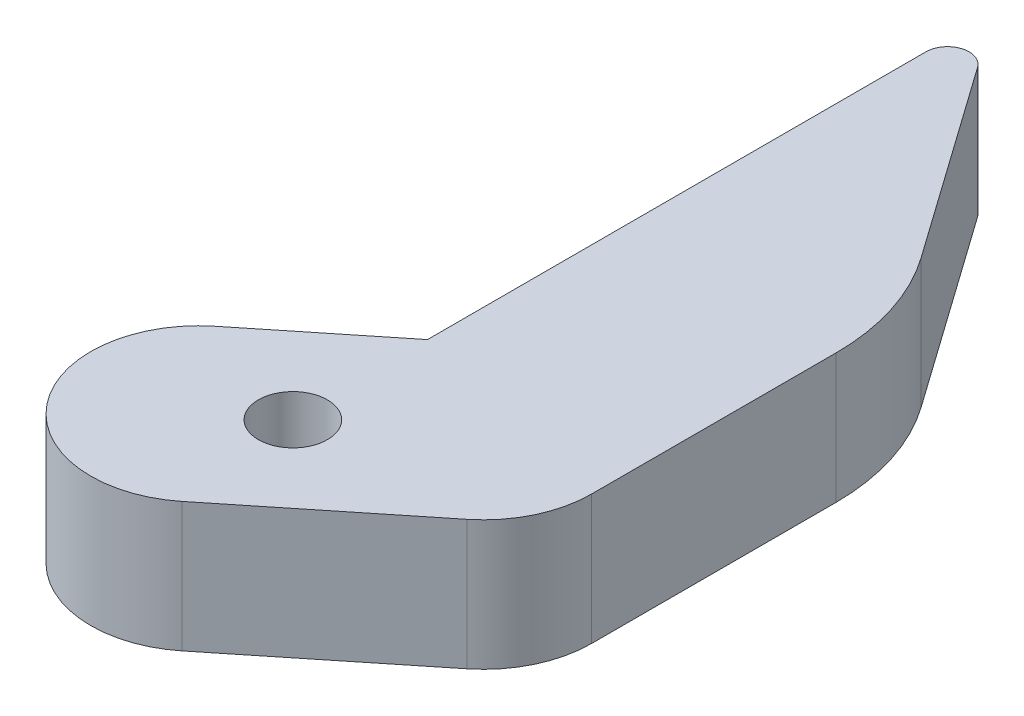
ISO-10303-21;
HEADER;
FILE_DESCRIPTION(('STEP AP214'),'2;1');
FILE_NAME('part.step','',(''),(''),'','','');
FILE_SCHEMA(('AUTOMOTIVE_DESIGN { 1 0 10303 214 1 1 1 1 }'));
ENDSEC;
DATA;
#1=APPLICATION_CONTEXT('core data for automotive mechanical design processes');
#2=APPLICATION_PROTOCOL_DEFINITION('international standard','automotive_design',2000,#1);
#3=PRODUCT_CONTEXT('',#1,'mechanical');
#4=PRODUCT('Part','Part','',(#3));
#5=PRODUCT_RELATED_PRODUCT_CATEGORY('part','',(#4));
#6=PRODUCT_DEFINITION_FORMATION('','',#4);
#7=PRODUCT_DEFINITION_CONTEXT('part definition',#1,'design');
#8=PRODUCT_DEFINITION('design','',#6,#7);
#9=PRODUCT_DEFINITION_SHAPE('','',#8);
#10=(LENGTH_UNIT() NAMED_UNIT(*) SI_UNIT(.MILLI.,.METRE.));
#11=(NAMED_UNIT(*) PLANE_ANGLE_UNIT() SI_UNIT($,.RADIAN.));
#12=(NAMED_UNIT(*) SI_UNIT($,.STERADIAN.) SOLID_ANGLE_UNIT());
#13=UNCERTAINTY_MEASURE_WITH_UNIT(LENGTH_MEASURE(1.E-05),#10,'distance_accuracy_value','');
#14=(GEOMETRIC_REPRESENTATION_CONTEXT(3) GLOBAL_UNCERTAINTY_ASSIGNED_CONTEXT((#13)) GLOBAL_UNIT_ASSIGNED_CONTEXT((#10,
#11,#12)) REPRESENTATION_CONTEXT('',''));
#15=CARTESIAN_POINT('',(0.,0.,0.));
#16=DIRECTION('',(0.,0.,1.));
#17=DIRECTION('',(1.,0.,0.));
#18=AXIS2_PLACEMENT_3D('',#15,#16,#17);
#19=CARTESIAN_POINT('',(-2.42195887519577,-6.,1.94672229834054));
#20=DIRECTION('',(0.,-1.,0.));
#21=DIRECTION('',(0.,0.,-1.));
#22=AXIS2_PLACEMENT_3D('',#19,#20,#21);
#23=CYLINDRICAL_SURFACE('',#22,4.99999999999996);
#24=CARTESIAN_POINT('',(-2.42195887519577,-12.,1.94672229834054));
#25=DIRECTION('',(0.,-1.,0.));
#26=DIRECTION('',(0.,0.,-1.));
#27=AXIS2_PLACEMENT_3D('',#24,#25,#26);
#28=CIRCLE('',#27,4.99999999999996);
#29=CARTESIAN_POINT('',(0.710490736046218,-12.,5.84386990050156));
#30=VERTEX_POINT('',#29);
#31=CARTESIAN_POINT('',(-5.55440848643782,-12.,-1.95042530382048));
#32=VERTEX_POINT('',#31);
#33=EDGE_CURVE('E180',#30,#32,#28,.T.);
#34=ORIENTED_EDGE('',*,*,#33,.F.);
#35=DIRECTION('',(0.,-1.,0.));
#36=VECTOR('',#35,1.);
#37=CARTESIAN_POINT('',(0.710490736046218,-6.,5.84386990050156));
#38=LINE('',#37,#36);
#39=CARTESIAN_POINT('',(0.710490736046218,-6.,5.84386990050156));
#40=VERTEX_POINT('',#39);
#41=EDGE_CURVE('E155',#40,#30,#38,.T.);
#42=ORIENTED_EDGE('',*,*,#41,.F.);
#43=CARTESIAN_POINT('',(-2.42195887519577,-6.,1.94672229834054));
#44=DIRECTION('',(0.,-1.,0.));
#45=DIRECTION('',(0.,0.,-1.));
#46=AXIS2_PLACEMENT_3D('',#43,#44,#45);
#47=CIRCLE('',#46,4.99999999999996);
#48=CARTESIAN_POINT('',(-5.55440848643782,-6.,-1.95042530382048));
#49=VERTEX_POINT('',#48);
#50=EDGE_CURVE('E172',#40,#49,#47,.T.);
#51=ORIENTED_EDGE('',*,*,#50,.T.);
#52=DIRECTION('',(0.,-1.,0.));
#53=VECTOR('',#52,1.);
#54=CARTESIAN_POINT('',(-5.55440848643782,-6.,-1.95042530382048));
#55=LINE('',#54,#53);
#56=EDGE_CURVE('E156',#49,#32,#55,.T.);
#57=ORIENTED_EDGE('',*,*,#56,.T.);
#58=EDGE_LOOP('',(#34,#42,#51,#57));
#59=FACE_BOUND('',#58,.T.);
#60=ADVANCED_FACE('F38',(#59),#23,.T.);
#61=CARTESIAN_POINT('',(8.03404776782973,-6.,-0.0426593560239417));
#62=DIRECTION('',(0.626489922248408,0.,0.779429520432209));
#63=DIRECTION('',(0.779429520432209,0.,-0.626489922248408));
#64=AXIS2_PLACEMENT_3D('',#61,#62,#63);
#65=PLANE('',#64);
#66=DIRECTION('',(-0.779429520432209,0.,0.626489922248408));
#67=VECTOR('',#66,1.);
#68=CARTESIAN_POINT('',(8.03404776782973,-12.,-0.0426593560239417));
#69=LINE('',#68,#67);
#70=CARTESIAN_POINT('',(8.03404776782973,-12.,-0.0426593560239417));
#71=VERTEX_POINT('',#70);
#72=EDGE_CURVE('E167',#71,#30,#69,.T.);
#73=ORIENTED_EDGE('',*,*,#72,.F.);
#74=DIRECTION('',(0.,-1.,0.));
#75=VECTOR('',#74,1.);
#76=CARTESIAN_POINT('',(8.03404776782973,-6.,-0.0426593560239417));
#77=LINE('',#76,#75);
#78=CARTESIAN_POINT('',(8.03404776782973,-6.,-0.0426593560239417));
#79=VERTEX_POINT('',#78);
#80=EDGE_CURVE('E164',#79,#71,#77,.T.);
#81=ORIENTED_EDGE('',*,*,#80,.F.);
#82=DIRECTION('',(-0.779429520432209,0.,0.626489922248408));
#83=VECTOR('',#82,1.);
#84=CARTESIAN_POINT('',(8.03404776782973,-6.,-0.0426593560239417));
#85=LINE('',#84,#83);
#86=EDGE_CURVE('E159',#79,#40,#85,.T.);
#87=ORIENTED_EDGE('',*,*,#86,.T.);
#88=ORIENTED_EDGE('',*,*,#41,.T.);
#89=EDGE_LOOP('',(#73,#81,#87,#88));
#90=FACE_BOUND('',#89,.T.);
#91=ADVANCED_FACE('F198',(#90),#65,.T.);
#92=CARTESIAN_POINT('',(4.90159815658769,-6.,-3.93980695818495));
#93=DIRECTION('',(0.,-1.,0.));
#94=DIRECTION('',(0.,0.,-1.));
#95=AXIS2_PLACEMENT_3D('',#92,#93,#94);
#96=CYLINDRICAL_SURFACE('',#95,4.99999999999999);
#97=CARTESIAN_POINT('',(4.90159815658769,-12.,-3.93980695818495));
#98=DIRECTION('',(0.,-1.,0.));
#99=DIRECTION('',(0.,0.,-1.));
#100=AXIS2_PLACEMENT_3D('',#97,#98,#99);
#101=CIRCLE('',#100,4.99999999999999);
#102=CARTESIAN_POINT('',(9.90159815658768,-12.,-3.93980695818495));
#103=VERTEX_POINT('',#102);
#104=EDGE_CURVE('E173',#103,#71,#101,.T.);
#105=ORIENTED_EDGE('',*,*,#104,.F.);
#106=DIRECTION('',(0.,-1.,0.));
#107=VECTOR('',#106,1.);
#108=CARTESIAN_POINT('',(9.90159815658768,-6.,-3.93980695818495));
#109=LINE('',#108,#107);
#110=CARTESIAN_POINT('',(9.90159815658768,-6.,-3.93980695818495));
#111=VERTEX_POINT('',#110);
#112=EDGE_CURVE('E161',#111,#103,#109,.T.);
#113=ORIENTED_EDGE('',*,*,#112,.F.);
#114=CARTESIAN_POINT('',(4.90159815658769,-6.,-3.93980695818495));
#115=DIRECTION('',(0.,-1.,0.));
#116=DIRECTION('',(0.,0.,-1.));
#117=AXIS2_PLACEMENT_3D('',#114,#115,#116);
#118=CIRCLE('',#117,4.99999999999999);
#119=EDGE_CURVE('E216',#111,#79,#118,.T.);
#120=ORIENTED_EDGE('',*,*,#119,.T.);
#121=ORIENTED_EDGE('',*,*,#80,.T.);
#122=EDGE_LOOP('',(#105,#113,#120,#121));
#123=FACE_BOUND('',#122,.T.);
#124=ADVANCED_FACE('F221',(#123),#96,.T.);
#125=CARTESIAN_POINT('',(9.90159815658769,-6.,-12.4542911190457));
#126=DIRECTION('',(1.,0.,0.));
#127=DIRECTION('',(0.,0.,-1.));
#128=AXIS2_PLACEMENT_3D('',#125,#126,#127);
#129=PLANE('',#128);
#130=DIRECTION('',(0.,0.,1.));
#131=VECTOR('',#130,1.);
#132=CARTESIAN_POINT('',(9.90159815658769,-12.,-12.4542911190457));
#133=LINE('',#132,#131);
#134=CARTESIAN_POINT('',(9.90159815658769,-12.,-15.268543037492));
#135=VERTEX_POINT('',#134);
#136=EDGE_CURVE('E117',#135,#103,#133,.T.);
#137=ORIENTED_EDGE('',*,*,#136,.F.);
#138=DIRECTION('',(0.,-1.,0.));
#139=VECTOR('',#138,1.);
#140=CARTESIAN_POINT('',(9.90159815658769,-6.,-15.268543037492));
#141=LINE('',#140,#139);
#142=CARTESIAN_POINT('',(9.90159815658769,-6.,-15.268543037492));
#143=VERTEX_POINT('',#142);
#144=EDGE_CURVE('E46',#135,#143,#141,.F.);
#145=ORIENTED_EDGE('',*,*,#144,.T.);
#146=DIRECTION('',(0.,0.,1.));
#147=VECTOR('',#146,1.);
#148=CARTESIAN_POINT('',(9.90159815658769,-6.,-12.4542911190457));
#149=LINE('',#148,#147);
#150=EDGE_CURVE('E214',#143,#111,#149,.T.);
#151=ORIENTED_EDGE('',*,*,#150,.T.);
#152=ORIENTED_EDGE('',*,*,#112,.T.);
#153=EDGE_LOOP('',(#137,#145,#151,#152));
#154=FACE_BOUND('',#153,.T.);
#155=ADVANCED_FACE('F250',(#154),#129,.T.);
#156=CARTESIAN_POINT('',(-0.0984018434123102,-6.,-6.3358547595594));
#157=DIRECTION('',(-1.,0.,0.));
#158=DIRECTION('',(0.,0.,1.));
#159=AXIS2_PLACEMENT_3D('',#156,#157,#158);
#160=PLANE('',#159);
#161=DIRECTION('',(0.,0.,-1.));
#162=VECTOR('',#161,1.);
#163=CARTESIAN_POINT('',(-0.0984018434123102,-12.,-6.3358547595594));
#164=LINE('',#163,#162);
#165=CARTESIAN_POINT('',(-0.0984018434123102,-12.,-6.3358547595594));
#166=VERTEX_POINT('',#165);
#167=CARTESIAN_POINT('',(-0.0984018434123134,-12.,-29.4341911869933));
#168=VERTEX_POINT('',#167);
#169=EDGE_CURVE('E107',#166,#168,#164,.T.);
#170=ORIENTED_EDGE('',*,*,#169,.F.);
#171=DIRECTION('',(0.,-1.,0.));
#172=VECTOR('',#171,1.);
#173=CARTESIAN_POINT('',(-0.0984018434123102,-6.,-6.3358547595594));
#174=LINE('',#173,#172);
#175=CARTESIAN_POINT('',(-0.0984018434123102,-6.,-6.3358547595594));
#176=VERTEX_POINT('',#175);
#177=EDGE_CURVE('E158',#176,#166,#174,.T.);
#178=ORIENTED_EDGE('',*,*,#177,.F.);
#179=DIRECTION('',(0.,0.,-1.));
#180=VECTOR('',#179,1.);
#181=CARTESIAN_POINT('',(-0.0984018434123102,-6.,-6.3358547595594));
#182=LINE('',#181,#180);
#183=CARTESIAN_POINT('',(-0.0984018434123126,-6.,-29.4341911869933));
#184=VERTEX_POINT('',#183);
#185=EDGE_CURVE('E123',#176,#184,#182,.T.);
#186=ORIENTED_EDGE('',*,*,#185,.T.);
#187=DIRECTION('',(0.,-1.,0.));
#188=VECTOR('',#187,1.);
#189=CARTESIAN_POINT('',(-0.0984018434123134,14.5736920958146,-29.4341911869933));
#190=LINE('',#189,#188);
#191=EDGE_CURVE('E120',#184,#168,#190,.T.);
#192=ORIENTED_EDGE('',*,*,#191,.T.);
#193=EDGE_LOOP('',(#170,#178,#186,#192));
#194=FACE_BOUND('',#193,.T.);
#195=ADVANCED_FACE('F121',(#194),#160,.T.);
#196=CARTESIAN_POINT('',(-5.55440848643782,-6.,-1.95042530382048));
#197=DIRECTION('',(-0.62648992224841,0.,-0.779429520432207));
#198=DIRECTION('',(-0.779429520432207,0.,0.626489922248411));
#199=AXIS2_PLACEMENT_3D('',#196,#197,#198);
#200=PLANE('',#199);
#201=DIRECTION('',(0.779429520432207,0.,-0.626489922248411));
#202=VECTOR('',#201,1.);
#203=CARTESIAN_POINT('',(-5.55440848643782,-12.,-1.95042530382048));
#204=LINE('',#203,#202);
#205=EDGE_CURVE('E114',#32,#166,#204,.T.);
#206=ORIENTED_EDGE('',*,*,#205,.F.);
#207=ORIENTED_EDGE('',*,*,#56,.F.);
#208=DIRECTION('',(0.779429520432207,0.,-0.626489922248411));
#209=VECTOR('',#208,1.);
#210=CARTESIAN_POINT('',(-5.55440848643782,-6.,-1.95042530382048));
#211=LINE('',#210,#209);
#212=EDGE_CURVE('E210',#49,#176,#211,.T.);
#213=ORIENTED_EDGE('',*,*,#212,.T.);
#214=ORIENTED_EDGE('',*,*,#177,.T.);
#215=EDGE_LOOP('',(#206,#207,#213,#214));
#216=FACE_BOUND('',#215,.T.);
#217=ADVANCED_FACE('F209',(#216),#200,.T.);
#218=CARTESIAN_POINT('',(-2.42195887519577,-6.,1.94672229834054));
#219=DIRECTION('',(0.,-1.,0.));
#220=DIRECTION('',(0.,0.,-1.));
#221=AXIS2_PLACEMENT_3D('',#218,#219,#220);
#222=PLANE('',#221);
#223=CARTESIAN_POINT('',(0.,-6.,0.));
#224=DIRECTION('',(0.,-1.,0.));
#225=DIRECTION('',(0.,0.,1.));
#226=AXIS2_PLACEMENT_3D('',#223,#224,#225);
#227=CIRCLE('',#226,1.6);
#228=CARTESIAN_POINT('',(0.,-6.,1.6));
#229=VERTEX_POINT('',#228);
#230=EDGE_CURVE('E184',#229,#229,#227,.T.);
#231=ORIENTED_EDGE('',*,*,#230,.T.);
#232=EDGE_LOOP('',(#231));
#233=FACE_BOUND('',#232,.T.);
#234=ORIENTED_EDGE('',*,*,#150,.F.);
#235=CARTESIAN_POINT('',(-0.0984018434123102,-6.,-15.268543037492));
#236=DIRECTION('',(0.,-1.,0.));
#237=DIRECTION('',(0.,0.,-1.));
#238=AXIS2_PLACEMENT_3D('',#235,#236,#237);
#239=CIRCLE('',#238,10.);
#240=CARTESIAN_POINT('',(8.06395529462081,-6.,-21.0457331807364));
#241=VERTEX_POINT('',#240);
#242=EDGE_CURVE('E12',#143,#241,#239,.F.);
#243=ORIENTED_EDGE('',*,*,#242,.T.);
#244=DIRECTION('',(-0.577719014324436,0.,-0.816235713803312));
#245=VECTOR('',#244,1.);
#246=CARTESIAN_POINT('',(15.2967539845867,-6.,-10.8268058906184));
#247=LINE('',#246,#245);
#248=CARTESIAN_POINT('',(1.717833870391,-6.,-30.0119102013178));
#249=VERTEX_POINT('',#248);
#250=EDGE_CURVE('E138',#241,#249,#247,.T.);
#251=ORIENTED_EDGE('',*,*,#250,.T.);
#252=CARTESIAN_POINT('',(0.901598156587687,-6.,-29.4341911869933));
#253=DIRECTION('',(0.,-1.,0.));
#254=DIRECTION('',(0.,0.,-1.));
#255=AXIS2_PLACEMENT_3D('',#252,#253,#254);
#256=CIRCLE('',#255,0.999999999999999);
#257=EDGE_CURVE('E213',#249,#184,#256,.F.);
#258=ORIENTED_EDGE('',*,*,#257,.T.);
#259=ORIENTED_EDGE('',*,*,#185,.F.);
#260=ORIENTED_EDGE('',*,*,#212,.F.);
#261=ORIENTED_EDGE('',*,*,#50,.F.);
#262=ORIENTED_EDGE('',*,*,#86,.F.);
#263=ORIENTED_EDGE('',*,*,#119,.F.);
#264=EDGE_LOOP('',(#234,#243,#251,#258,#259,#260,#261,#262,#263));
#265=FACE_BOUND('',#264,.T.);
#266=ADVANCED_FACE('F212',(#233,#265),#222,.F.);
#267=CARTESIAN_POINT('',(-2.42195887519577,-12.,1.94672229834054));
#268=DIRECTION('',(0.,-1.,0.));
#269=DIRECTION('',(0.,0.,-1.));
#270=AXIS2_PLACEMENT_3D('',#267,#268,#269);
#271=PLANE('',#270);
#272=CARTESIAN_POINT('',(0.,-12.,0.));
#273=DIRECTION('',(0.,-1.,0.));
#274=DIRECTION('',(0.,0.,1.));
#275=AXIS2_PLACEMENT_3D('',#272,#273,#274);
#276=CIRCLE('',#275,1.6);
#277=CARTESIAN_POINT('',(0.,-12.,1.6));
#278=VERTEX_POINT('',#277);
#279=EDGE_CURVE('E222',#278,#278,#276,.T.);
#280=ORIENTED_EDGE('',*,*,#279,.F.);
#281=EDGE_LOOP('',(#280));
#282=FACE_BOUND('',#281,.T.);
#283=DIRECTION('',(0.577719014324436,0.,0.816235713803312));
#284=VECTOR('',#283,1.);
#285=CARTESIAN_POINT('',(15.2967539845867,-12.,-10.8268058906184));
#286=LINE('',#285,#284);
#287=CARTESIAN_POINT('',(1.717833870391,-12.,-30.0119102013178));
#288=VERTEX_POINT('',#287);
#289=CARTESIAN_POINT('',(8.06395529462081,-12.,-21.0457331807364));
#290=VERTEX_POINT('',#289);
#291=EDGE_CURVE('E128',#288,#290,#286,.T.);
#292=ORIENTED_EDGE('',*,*,#291,.T.);
#293=CARTESIAN_POINT('',(-0.0984018434123102,-12.,-15.268543037492));
#294=DIRECTION('',(0.,-1.,0.));
#295=DIRECTION('',(0.,0.,-1.));
#296=AXIS2_PLACEMENT_3D('',#293,#294,#295);
#297=CIRCLE('',#296,10.);
#298=EDGE_CURVE('E60',#290,#135,#297,.T.);
#299=ORIENTED_EDGE('',*,*,#298,.T.);
#300=ORIENTED_EDGE('',*,*,#136,.T.);
#301=ORIENTED_EDGE('',*,*,#104,.T.);
#302=ORIENTED_EDGE('',*,*,#72,.T.);
#303=ORIENTED_EDGE('',*,*,#33,.T.);
#304=ORIENTED_EDGE('',*,*,#205,.T.);
#305=ORIENTED_EDGE('',*,*,#169,.T.);
#306=CARTESIAN_POINT('',(0.901598156587687,-12.,-29.4341911869933));
#307=DIRECTION('',(0.,-1.,0.));
#308=DIRECTION('',(0.,0.,-1.));
#309=AXIS2_PLACEMENT_3D('',#306,#307,#308);
#310=CIRCLE('',#309,0.999999999999999);
#311=EDGE_CURVE('E111',#168,#288,#310,.T.);
#312=ORIENTED_EDGE('',*,*,#311,.T.);
#313=EDGE_LOOP('',(#292,#299,#300,#301,#302,#303,#304,#305,#312));
#314=FACE_BOUND('',#313,.T.);
#315=ADVANCED_FACE('F109',(#282,#314),#271,.T.);
#316=CARTESIAN_POINT('',(0.,-6.,0.));
#317=DIRECTION('',(0.,-1.,0.));
#318=DIRECTION('',(0.,0.,-1.));
#319=AXIS2_PLACEMENT_3D('',#316,#317,#318);
#320=CYLINDRICAL_SURFACE('',#319,1.6);
#321=ORIENTED_EDGE('',*,*,#230,.F.);
#322=EDGE_LOOP('',(#321));
#323=FACE_BOUND('',#322,.T.);
#324=ORIENTED_EDGE('',*,*,#279,.T.);
#325=EDGE_LOOP('',(#324));
#326=FACE_BOUND('',#325,.T.);
#327=ADVANCED_FACE('F257',(#323,#326),#320,.F.);
#328=CARTESIAN_POINT('',(15.2967539845867,14.5736920958146,-10.8268058906184));
#329=DIRECTION('',(0.816235713803312,0.,-0.577719014324436));
#330=DIRECTION('',(-0.577719014324436,0.,-0.816235713803312));
#331=AXIS2_PLACEMENT_3D('',#328,#329,#330);
#332=PLANE('',#331);
#333=ORIENTED_EDGE('',*,*,#250,.F.);
#334=DIRECTION('',(0.,-1.,0.));
#335=VECTOR('',#334,1.);
#336=CARTESIAN_POINT('',(8.06395529462081,14.5736920958146,-21.0457331807364));
#337=LINE('',#336,#335);
#338=EDGE_CURVE('E152',#241,#290,#337,.T.);
#339=ORIENTED_EDGE('',*,*,#338,.T.);
#340=ORIENTED_EDGE('',*,*,#291,.F.);
#341=DIRECTION('',(0.,-1.,0.));
#342=VECTOR('',#341,1.);
#343=CARTESIAN_POINT('',(1.717833870391,14.5736920958146,-30.0119102013178));
#344=LINE('',#343,#342);
#345=EDGE_CURVE('E127',#249,#288,#344,.T.);
#346=ORIENTED_EDGE('',*,*,#345,.F.);
#347=EDGE_LOOP('',(#333,#339,#340,#346));
#348=FACE_BOUND('',#347,.T.);
#349=ADVANCED_FACE('F233',(#348),#332,.T.);
#350=CARTESIAN_POINT('',(0.901598156587687,14.5736920958146,-29.4341911869933));
#351=DIRECTION('',(0.,-1.,0.));
#352=DIRECTION('',(0.,0.,-1.));
#353=AXIS2_PLACEMENT_3D('',#350,#351,#352);
#354=CYLINDRICAL_SURFACE('',#353,0.999999999999999);
#355=ORIENTED_EDGE('',*,*,#257,.F.);
#356=ORIENTED_EDGE('',*,*,#345,.T.);
#357=ORIENTED_EDGE('',*,*,#311,.F.);
#358=ORIENTED_EDGE('',*,*,#191,.F.);
#359=EDGE_LOOP('',(#355,#356,#357,#358));
#360=FACE_BOUND('',#359,.T.);
#361=ADVANCED_FACE('F130',(#360),#354,.T.);
#362=CARTESIAN_POINT('',(-0.0984018434123102,14.5736920958146,-15.268543037492));
#363=DIRECTION('',(0.,-1.,0.));
#364=DIRECTION('',(0.,0.,-1.));
#365=AXIS2_PLACEMENT_3D('',#362,#363,#364);
#366=CYLINDRICAL_SURFACE('',#365,10.);
#367=ORIENTED_EDGE('',*,*,#242,.F.);
#368=ORIENTED_EDGE('',*,*,#144,.F.);
#369=ORIENTED_EDGE('',*,*,#298,.F.);
#370=ORIENTED_EDGE('',*,*,#338,.F.);
#371=EDGE_LOOP('',(#367,#368,#369,#370));
#372=FACE_BOUND('',#371,.T.);
#373=ADVANCED_FACE('F40',(#372),#366,.T.);
#374=CLOSED_SHELL('',(#60,#91,#124,#155,#195,#217,#266,#315,#327,#349,#361,#373));
#375=MANIFOLD_SOLID_BREP('B2',#374);
#376=ADVANCED_BREP_SHAPE_REPRESENTATION('',(#18,#375),#14);
#377=SHAPE_DEFINITION_REPRESENTATION(#9,#376);
ENDSEC;
END-ISO-10303-21;
